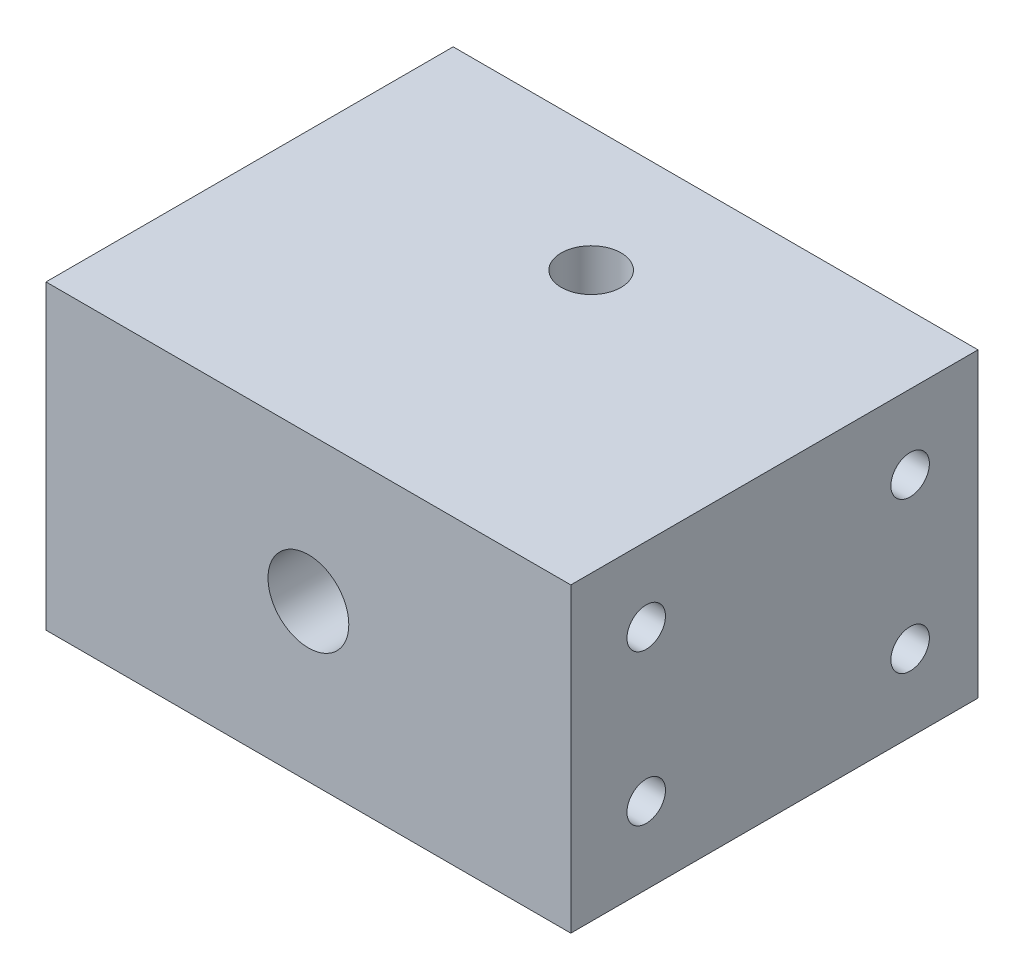
ISO-10303-21;
HEADER;
FILE_DESCRIPTION(('STEP AP214'),'2;1');
FILE_NAME('part.step','',(''),(''),'','','');
FILE_SCHEMA(('AUTOMOTIVE_DESIGN { 1 0 10303 214 1 1 1 1 }'));
ENDSEC;
DATA;
#1=APPLICATION_CONTEXT('core data for automotive mechanical design processes');
#2=APPLICATION_PROTOCOL_DEFINITION('international standard','automotive_design',2000,#1);
#3=PRODUCT_CONTEXT('',#1,'mechanical');
#4=PRODUCT('Part','Part','',(#3));
#5=PRODUCT_RELATED_PRODUCT_CATEGORY('part','',(#4));
#6=PRODUCT_DEFINITION_FORMATION('','',#4);
#7=PRODUCT_DEFINITION_CONTEXT('part definition',#1,'design');
#8=PRODUCT_DEFINITION('design','',#6,#7);
#9=PRODUCT_DEFINITION_SHAPE('','',#8);
#10=(LENGTH_UNIT() NAMED_UNIT(*) SI_UNIT(.MILLI.,.METRE.));
#11=(NAMED_UNIT(*) PLANE_ANGLE_UNIT() SI_UNIT($,.RADIAN.));
#12=(NAMED_UNIT(*) SI_UNIT($,.STERADIAN.) SOLID_ANGLE_UNIT());
#13=UNCERTAINTY_MEASURE_WITH_UNIT(LENGTH_MEASURE(1.E-05),#10,'distance_accuracy_value','');
#14=(GEOMETRIC_REPRESENTATION_CONTEXT(3) GLOBAL_UNCERTAINTY_ASSIGNED_CONTEXT((#13)) GLOBAL_UNIT_ASSIGNED_CONTEXT((#10,
#11,#12)) REPRESENTATION_CONTEXT('',''));
#15=CARTESIAN_POINT('',(0.,0.,0.));
#16=DIRECTION('',(0.,0.,1.));
#17=DIRECTION('',(1.,0.,0.));
#18=AXIS2_PLACEMENT_3D('',#15,#16,#17);
#19=CARTESIAN_POINT('',(-34.8,40.,-37.5));
#20=DIRECTION('',(1.,0.,0.));
#21=DIRECTION('',(0.,0.,-1.));
#22=AXIS2_PLACEMENT_3D('',#19,#20,#21);
#23=PLANE('',#22);
#24=CARTESIAN_POINT('',(-34.8,30.16,-7.50000000000002));
#25=DIRECTION('',(-1.,0.,0.));
#26=DIRECTION('',(0.,0.,1.));
#27=AXIS2_PLACEMENT_3D('',#24,#25,#26);
#28=CIRCLE('',#27,2.5527);
#29=CARTESIAN_POINT('',(-34.8,30.16,-4.94730000000002));
#30=VERTEX_POINT('',#29);
#31=EDGE_CURVE('E165',#30,#30,#28,.T.);
#32=ORIENTED_EDGE('',*,*,#31,.F.);
#33=EDGE_LOOP('',(#32));
#34=FACE_BOUND('',#33,.T.);
#35=CARTESIAN_POINT('',(-34.8,10.16,-7.50000000000001));
#36=DIRECTION('',(-1.,0.,0.));
#37=DIRECTION('',(0.,0.,1.));
#38=AXIS2_PLACEMENT_3D('',#35,#36,#37);
#39=CIRCLE('',#38,2.5527);
#40=CARTESIAN_POINT('',(-34.8,10.16,-4.94730000000001));
#41=VERTEX_POINT('',#40);
#42=EDGE_CURVE('E173',#41,#41,#39,.T.);
#43=ORIENTED_EDGE('',*,*,#42,.F.);
#44=EDGE_LOOP('',(#43));
#45=FACE_BOUND('',#44,.T.);
#46=CARTESIAN_POINT('',(-34.8,10.16,27.5));
#47=DIRECTION('',(-1.,0.,0.));
#48=DIRECTION('',(0.,0.,1.));
#49=AXIS2_PLACEMENT_3D('',#46,#47,#48);
#50=CIRCLE('',#49,2.5527);
#51=CARTESIAN_POINT('',(-34.8,10.16,30.0527));
#52=VERTEX_POINT('',#51);
#53=EDGE_CURVE('E181',#52,#52,#50,.T.);
#54=ORIENTED_EDGE('',*,*,#53,.F.);
#55=EDGE_LOOP('',(#54));
#56=FACE_BOUND('',#55,.T.);
#57=CARTESIAN_POINT('',(-34.8,30.16,27.5));
#58=DIRECTION('',(-1.,0.,0.));
#59=DIRECTION('',(0.,0.,1.));
#60=AXIS2_PLACEMENT_3D('',#57,#58,#59);
#61=CIRCLE('',#60,2.5527);
#62=CARTESIAN_POINT('',(-34.8,30.16,30.0527));
#63=VERTEX_POINT('',#62);
#64=EDGE_CURVE('E189',#63,#63,#61,.T.);
#65=ORIENTED_EDGE('',*,*,#64,.F.);
#66=EDGE_LOOP('',(#65));
#67=FACE_BOUND('',#66,.T.);
#68=DIRECTION('',(0.,1.,0.));
#69=VECTOR('',#68,1.);
#70=CARTESIAN_POINT('',(-34.8,40.,-16.5));
#71=LINE('',#70,#69);
#72=CARTESIAN_POINT('',(-34.8,0.,-16.5));
#73=VERTEX_POINT('',#72);
#74=CARTESIAN_POINT('',(-34.8,40.,-16.5));
#75=VERTEX_POINT('',#74);
#76=EDGE_CURVE('E243',#73,#75,#71,.T.);
#77=ORIENTED_EDGE('',*,*,#76,.F.);
#78=DIRECTION('',(0.,0.,1.));
#79=VECTOR('',#78,1.);
#80=CARTESIAN_POINT('',(-34.8,0.,-37.5));
#81=LINE('',#80,#79);
#82=CARTESIAN_POINT('',(-34.8,0.,37.5));
#83=VERTEX_POINT('',#82);
#84=EDGE_CURVE('E246',#73,#83,#81,.T.);
#85=ORIENTED_EDGE('',*,*,#84,.T.);
#86=DIRECTION('',(0.,-1.,0.));
#87=VECTOR('',#86,1.);
#88=CARTESIAN_POINT('',(-34.8,40.,37.5));
#89=LINE('',#88,#87);
#90=CARTESIAN_POINT('',(-34.8,40.,37.5));
#91=VERTEX_POINT('',#90);
#92=EDGE_CURVE('E270',#91,#83,#89,.T.);
#93=ORIENTED_EDGE('',*,*,#92,.F.);
#94=DIRECTION('',(0.,0.,1.));
#95=VECTOR('',#94,1.);
#96=CARTESIAN_POINT('',(-34.8,40.,-37.5));
#97=LINE('',#96,#95);
#98=EDGE_CURVE('E247',#75,#91,#97,.T.);
#99=ORIENTED_EDGE('',*,*,#98,.F.);
#100=EDGE_LOOP('',(#77,#85,#93,#99));
#101=FACE_BOUND('',#100,.T.);
#102=ADVANCED_FACE('F39',(#34,#45,#56,#67,#101),#23,.F.);
#103=CARTESIAN_POINT('',(34.8,40.,-37.5));
#104=DIRECTION('',(-1.,0.,0.));
#105=DIRECTION('',(0.,0.,1.));
#106=AXIS2_PLACEMENT_3D('',#103,#104,#105);
#107=PLANE('',#106);
#108=CARTESIAN_POINT('',(34.8,30.16,-7.50000000000002));
#109=DIRECTION('',(1.,0.,0.));
#110=DIRECTION('',(0.,0.,-1.));
#111=AXIS2_PLACEMENT_3D('',#108,#109,#110);
#112=CIRCLE('',#111,2.5527);
#113=CARTESIAN_POINT('',(34.8,30.16,-10.0527));
#114=VERTEX_POINT('',#113);
#115=EDGE_CURVE('E197',#114,#114,#112,.T.);
#116=ORIENTED_EDGE('',*,*,#115,.F.);
#117=EDGE_LOOP('',(#116));
#118=FACE_BOUND('',#117,.T.);
#119=CARTESIAN_POINT('',(34.8,10.16,-7.50000000000001));
#120=DIRECTION('',(1.,0.,0.));
#121=DIRECTION('',(0.,0.,-1.));
#122=AXIS2_PLACEMENT_3D('',#119,#120,#121);
#123=CIRCLE('',#122,2.5527);
#124=CARTESIAN_POINT('',(34.8,10.16,-10.0527));
#125=VERTEX_POINT('',#124);
#126=EDGE_CURVE('E205',#125,#125,#123,.T.);
#127=ORIENTED_EDGE('',*,*,#126,.F.);
#128=EDGE_LOOP('',(#127));
#129=FACE_BOUND('',#128,.T.);
#130=CARTESIAN_POINT('',(34.8,10.16,27.5));
#131=DIRECTION('',(1.,0.,0.));
#132=DIRECTION('',(0.,0.,-1.));
#133=AXIS2_PLACEMENT_3D('',#130,#131,#132);
#134=CIRCLE('',#133,2.5527);
#135=CARTESIAN_POINT('',(34.8,10.16,24.9473));
#136=VERTEX_POINT('',#135);
#137=EDGE_CURVE('E213',#136,#136,#134,.T.);
#138=ORIENTED_EDGE('',*,*,#137,.F.);
#139=EDGE_LOOP('',(#138));
#140=FACE_BOUND('',#139,.T.);
#141=CARTESIAN_POINT('',(34.8,30.16,27.5));
#142=DIRECTION('',(1.,0.,0.));
#143=DIRECTION('',(0.,0.,-1.));
#144=AXIS2_PLACEMENT_3D('',#141,#142,#143);
#145=CIRCLE('',#144,2.5527);
#146=CARTESIAN_POINT('',(34.8,30.16,24.9473));
#147=VERTEX_POINT('',#146);
#148=EDGE_CURVE('E221',#147,#147,#145,.T.);
#149=ORIENTED_EDGE('',*,*,#148,.F.);
#150=EDGE_LOOP('',(#149));
#151=FACE_BOUND('',#150,.T.);
#152=DIRECTION('',(0.,-1.,0.));
#153=VECTOR('',#152,1.);
#154=CARTESIAN_POINT('',(34.8,40.,-16.5));
#155=LINE('',#154,#153);
#156=CARTESIAN_POINT('',(34.8,40.,-16.5));
#157=VERTEX_POINT('',#156);
#158=CARTESIAN_POINT('',(34.8,0.,-16.5));
#159=VERTEX_POINT('',#158);
#160=EDGE_CURVE('E240',#157,#159,#155,.T.);
#161=ORIENTED_EDGE('',*,*,#160,.F.);
#162=DIRECTION('',(0.,0.,-1.));
#163=VECTOR('',#162,1.);
#164=CARTESIAN_POINT('',(34.8,40.,-37.5));
#165=LINE('',#164,#163);
#166=CARTESIAN_POINT('',(34.8,40.,37.5));
#167=VERTEX_POINT('',#166);
#168=EDGE_CURVE('E254',#167,#157,#165,.T.);
#169=ORIENTED_EDGE('',*,*,#168,.F.);
#170=DIRECTION('',(0.,-1.,0.));
#171=VECTOR('',#170,1.);
#172=CARTESIAN_POINT('',(34.8,40.,37.5));
#173=LINE('',#172,#171);
#174=CARTESIAN_POINT('',(34.8,0.,37.5));
#175=VERTEX_POINT('',#174);
#176=EDGE_CURVE('E258',#167,#175,#173,.T.);
#177=ORIENTED_EDGE('',*,*,#176,.T.);
#178=DIRECTION('',(0.,0.,-1.));
#179=VECTOR('',#178,1.);
#180=CARTESIAN_POINT('',(34.8,0.,-37.5));
#181=LINE('',#180,#179);
#182=EDGE_CURVE('E251',#175,#159,#181,.T.);
#183=ORIENTED_EDGE('',*,*,#182,.T.);
#184=EDGE_LOOP('',(#161,#169,#177,#183));
#185=FACE_BOUND('',#184,.T.);
#186=ADVANCED_FACE('F333',(#118,#129,#140,#151,#185),#107,.F.);
#187=CARTESIAN_POINT('',(0.,40.,0.));
#188=DIRECTION('',(0.,1.,0.));
#189=DIRECTION('',(0.,0.,1.));
#190=AXIS2_PLACEMENT_3D('',#187,#188,#189);
#191=PLANE('',#190);
#192=CARTESIAN_POINT('',(0.,40.,0.));
#193=DIRECTION('',(0.,1.,0.));
#194=DIRECTION('',(0.,0.,1.));
#195=AXIS2_PLACEMENT_3D('',#192,#193,#194);
#196=CIRCLE('',#195,3.96875);
#197=CARTESIAN_POINT('',(0.,40.,3.96875));
#198=VERTEX_POINT('',#197);
#199=EDGE_CURVE('E229',#198,#198,#196,.T.);
#200=ORIENTED_EDGE('',*,*,#199,.F.);
#201=EDGE_LOOP('',(#200));
#202=FACE_BOUND('',#201,.T.);
#203=ORIENTED_EDGE('',*,*,#168,.T.);
#204=DIRECTION('',(1.,0.,0.));
#205=VECTOR('',#204,1.);
#206=CARTESIAN_POINT('',(-72.700692263572,40.,-16.5));
#207=LINE('',#206,#205);
#208=EDGE_CURVE('E237',#75,#157,#207,.T.);
#209=ORIENTED_EDGE('',*,*,#208,.F.);
#210=ORIENTED_EDGE('',*,*,#98,.T.);
#211=DIRECTION('',(1.,0.,0.));
#212=VECTOR('',#211,1.);
#213=CARTESIAN_POINT('',(-34.8,40.,37.5));
#214=LINE('',#213,#212);
#215=EDGE_CURVE('E250',#91,#167,#214,.T.);
#216=ORIENTED_EDGE('',*,*,#215,.T.);
#217=EDGE_LOOP('',(#203,#209,#210,#216));
#218=FACE_BOUND('',#217,.T.);
#219=ADVANCED_FACE('F330',(#202,#218),#191,.T.);
#220=CARTESIAN_POINT('',(0.,0.,0.));
#221=DIRECTION('',(0.,1.,0.));
#222=DIRECTION('',(0.,0.,1.));
#223=AXIS2_PLACEMENT_3D('',#220,#221,#222);
#224=PLANE('',#223);
#225=DIRECTION('',(-1.,0.,0.));
#226=VECTOR('',#225,1.);
#227=CARTESIAN_POINT('',(0.,0.,-16.5));
#228=LINE('',#227,#226);
#229=CARTESIAN_POINT('',(-20.,0.,-16.5));
#230=VERTEX_POINT('',#229);
#231=EDGE_CURVE('E274',#230,#73,#228,.T.);
#232=ORIENTED_EDGE('',*,*,#231,.F.);
#233=DIRECTION('',(0.,0.,1.));
#234=VECTOR('',#233,1.);
#235=CARTESIAN_POINT('',(-20.,0.,0.));
#236=LINE('',#235,#234);
#237=CARTESIAN_POINT('',(-20.,0.,20.1823199310233));
#238=VERTEX_POINT('',#237);
#239=EDGE_CURVE('E154',#230,#238,#236,.T.);
#240=ORIENTED_EDGE('',*,*,#239,.T.);
#241=CARTESIAN_POINT('',(-18.,0.,20.1823199310233));
#242=DIRECTION('',(0.,1.,0.));
#243=DIRECTION('',(0.,0.,-1.));
#244=AXIS2_PLACEMENT_3D('',#241,#242,#243);
#245=ELLIPSE('',#244,4.73240316630509,2.);
#246=CARTESIAN_POINT('',(-18.,0.,24.9147230973284));
#247=VERTEX_POINT('',#246);
#248=EDGE_CURVE('E303',#238,#247,#245,.T.);
#249=ORIENTED_EDGE('',*,*,#248,.T.);
#250=DIRECTION('',(1.,0.,0.));
#251=VECTOR('',#250,1.);
#252=CARTESIAN_POINT('',(0.,0.,24.9147230973284));
#253=LINE('',#252,#251);
#254=CARTESIAN_POINT('',(18.,0.,24.9147230973284));
#255=VERTEX_POINT('',#254);
#256=EDGE_CURVE('E162',#247,#255,#253,.T.);
#257=ORIENTED_EDGE('',*,*,#256,.T.);
#258=CARTESIAN_POINT('',(18.,0.,20.1823199310233));
#259=DIRECTION('',(0.,1.,0.));
#260=DIRECTION('',(0.,0.,1.));
#261=AXIS2_PLACEMENT_3D('',#258,#259,#260);
#262=ELLIPSE('',#261,4.73240316630509,2.);
#263=CARTESIAN_POINT('',(20.,0.,20.1823199310233));
#264=VERTEX_POINT('',#263);
#265=EDGE_CURVE('E48',#255,#264,#262,.T.);
#266=ORIENTED_EDGE('',*,*,#265,.T.);
#267=DIRECTION('',(0.,0.,1.));
#268=VECTOR('',#267,1.);
#269=CARTESIAN_POINT('',(20.,0.,0.));
#270=LINE('',#269,#268);
#271=CARTESIAN_POINT('',(20.,0.,-16.5));
#272=VERTEX_POINT('',#271);
#273=EDGE_CURVE('E149',#272,#264,#270,.T.);
#274=ORIENTED_EDGE('',*,*,#273,.F.);
#275=EDGE_CURVE('E275',#159,#272,#228,.T.);
#276=ORIENTED_EDGE('',*,*,#275,.F.);
#277=ORIENTED_EDGE('',*,*,#182,.F.);
#278=DIRECTION('',(1.,0.,0.));
#279=VECTOR('',#278,1.);
#280=CARTESIAN_POINT('',(-34.8,0.,37.5));
#281=LINE('',#280,#279);
#282=EDGE_CURVE('E261',#83,#175,#281,.T.);
#283=ORIENTED_EDGE('',*,*,#282,.F.);
#284=ORIENTED_EDGE('',*,*,#84,.F.);
#285=EDGE_LOOP('',(#232,#240,#249,#257,#266,#274,#276,#277,#283,#284));
#286=FACE_BOUND('',#285,.T.);
#287=ADVANCED_FACE('F321',(#286),#224,.F.);
#288=CARTESIAN_POINT('',(-34.8,40.,37.5));
#289=DIRECTION('',(0.,0.,-1.));
#290=DIRECTION('',(-1.,0.,0.));
#291=AXIS2_PLACEMENT_3D('',#288,#289,#290);
#292=PLANE('',#291);
#293=CARTESIAN_POINT('',(0.,20.7188631564298,37.5));
#294=DIRECTION('',(0.,0.,1.));
#295=DIRECTION('',(1.,0.,0.));
#296=AXIS2_PLACEMENT_3D('',#293,#294,#295);
#297=CIRCLE('',#296,5.35813);
#298=CARTESIAN_POINT('',(5.35813,20.7188631564298,37.5));
#299=VERTEX_POINT('',#298);
#300=EDGE_CURVE('E150',#299,#299,#297,.T.);
#301=ORIENTED_EDGE('',*,*,#300,.F.);
#302=EDGE_LOOP('',(#301));
#303=FACE_BOUND('',#302,.T.);
#304=ORIENTED_EDGE('',*,*,#282,.T.);
#305=ORIENTED_EDGE('',*,*,#176,.F.);
#306=ORIENTED_EDGE('',*,*,#215,.F.);
#307=ORIENTED_EDGE('',*,*,#92,.T.);
#308=EDGE_LOOP('',(#304,#305,#306,#307));
#309=FACE_BOUND('',#308,.T.);
#310=ADVANCED_FACE('F327',(#303,#309),#292,.F.);
#311=CARTESIAN_POINT('',(-72.700692263572,40.,-16.5));
#312=DIRECTION('',(0.,0.,-1.));
#313=DIRECTION('',(-1.,0.,0.));
#314=AXIS2_PLACEMENT_3D('',#311,#312,#313);
#315=PLANE('',#314);
#316=DIRECTION('',(0.,1.,0.));
#317=VECTOR('',#316,1.);
#318=CARTESIAN_POINT('',(-20.,40.,-16.5));
#319=LINE('',#318,#317);
#320=CARTESIAN_POINT('',(-20.,17.1052467027275,-16.5));
#321=VERTEX_POINT('',#320);
#322=EDGE_CURVE('E286',#230,#321,#319,.T.);
#323=ORIENTED_EDGE('',*,*,#322,.F.);
#324=ORIENTED_EDGE('',*,*,#231,.T.);
#325=ORIENTED_EDGE('',*,*,#76,.T.);
#326=ORIENTED_EDGE('',*,*,#208,.T.);
#327=ORIENTED_EDGE('',*,*,#160,.T.);
#328=ORIENTED_EDGE('',*,*,#275,.T.);
#329=DIRECTION('',(0.,1.,0.));
#330=VECTOR('',#329,1.);
#331=CARTESIAN_POINT('',(20.,40.,-16.5));
#332=LINE('',#331,#330);
#333=CARTESIAN_POINT('',(20.,17.1052467027275,-16.5));
#334=VERTEX_POINT('',#333);
#335=EDGE_CURVE('E279',#272,#334,#332,.T.);
#336=ORIENTED_EDGE('',*,*,#335,.T.);
#337=CARTESIAN_POINT('',(18.,17.1052467027275,-16.5));
#338=DIRECTION('',(0.,0.,-1.));
#339=DIRECTION('',(0.,-1.,0.));
#340=AXIS2_PLACEMENT_3D('',#337,#338,#339);
#341=ELLIPSE('',#340,2.20675583792497,2.);
#342=CARTESIAN_POINT('',(18.,19.3120025406524,-16.5));
#343=VERTEX_POINT('',#342);
#344=EDGE_CURVE('E11',#334,#343,#341,.F.);
#345=ORIENTED_EDGE('',*,*,#344,.T.);
#346=DIRECTION('',(1.,0.,0.));
#347=VECTOR('',#346,1.);
#348=CARTESIAN_POINT('',(-72.700692263572,19.3120025406524,-16.5));
#349=LINE('',#348,#347);
#350=CARTESIAN_POINT('',(-18.,19.3120025406524,-16.5));
#351=VERTEX_POINT('',#350);
#352=EDGE_CURVE('E282',#351,#343,#349,.T.);
#353=ORIENTED_EDGE('',*,*,#352,.F.);
#354=CARTESIAN_POINT('',(-18.,17.1052467027275,-16.5));
#355=DIRECTION('',(0.,0.,-1.));
#356=DIRECTION('',(0.,1.,0.));
#357=AXIS2_PLACEMENT_3D('',#354,#355,#356);
#358=ELLIPSE('',#357,2.20675583792497,2.);
#359=EDGE_CURVE('E306',#351,#321,#358,.F.);
#360=ORIENTED_EDGE('',*,*,#359,.T.);
#361=EDGE_LOOP('',(#323,#324,#325,#326,#327,#328,#336,#345,#353,#360));
#362=FACE_BOUND('',#361,.T.);
#363=ADVANCED_FACE('F314',(#362),#315,.T.);
#364=CARTESIAN_POINT('',(0.,24.125,0.));
#365=DIRECTION('',(0.,1.,0.));
#366=DIRECTION('',(0.,0.,1.));
#367=AXIS2_PLACEMENT_3D('',#364,#365,#366);
#368=CONICAL_SURFACE('',#367,3.96875,1.02974425867665);
#369=CARTESIAN_POINT('',(0.,21.7403344182344,0.));
#370=VERTEX_POINT('',#369);
#371=VERTEX_LOOP('',#370);
#372=FACE_BOUND('',#371,.T.);
#373=CARTESIAN_POINT('',(0.,24.125,0.));
#374=DIRECTION('',(0.,1.,0.));
#375=DIRECTION('',(0.,0.,1.));
#376=AXIS2_PLACEMENT_3D('',#373,#374,#375);
#377=CIRCLE('',#376,3.96875);
#378=CARTESIAN_POINT('',(0.,24.125,3.96875));
#379=VERTEX_POINT('',#378);
#380=EDGE_CURVE('E233',#379,#379,#377,.T.);
#381=ORIENTED_EDGE('',*,*,#380,.T.);
#382=EDGE_LOOP('',(#381));
#383=FACE_BOUND('',#382,.T.);
#384=ADVANCED_FACE('F447',(#372,#383),#368,.F.);
#385=CARTESIAN_POINT('',(0.,40.,0.));
#386=DIRECTION('',(0.,1.,0.));
#387=DIRECTION('',(0.,0.,1.));
#388=AXIS2_PLACEMENT_3D('',#385,#386,#387);
#389=CYLINDRICAL_SURFACE('',#388,3.96875);
#390=ORIENTED_EDGE('',*,*,#380,.F.);
#391=EDGE_LOOP('',(#390));
#392=FACE_BOUND('',#391,.T.);
#393=ORIENTED_EDGE('',*,*,#199,.T.);
#394=EDGE_LOOP('',(#393));
#395=FACE_BOUND('',#394,.T.);
#396=ADVANCED_FACE('F443',(#392,#395),#389,.F.);
#397=CARTESIAN_POINT('',(21.8,30.16,27.5));
#398=DIRECTION('',(1.,0.,0.));
#399=DIRECTION('',(0.,0.,-1.));
#400=AXIS2_PLACEMENT_3D('',#397,#398,#399);
#401=CONICAL_SURFACE('',#400,2.55269999999999,1.02974425867665);
#402=CARTESIAN_POINT('',(20.2661830978084,30.16,27.5));
#403=VERTEX_POINT('',#402);
#404=VERTEX_LOOP('',#403);
#405=FACE_BOUND('',#404,.T.);
#406=CARTESIAN_POINT('',(21.8,30.16,27.5));
#407=DIRECTION('',(1.,0.,0.));
#408=DIRECTION('',(0.,0.,-1.));
#409=AXIS2_PLACEMENT_3D('',#406,#407,#408);
#410=CIRCLE('',#409,2.55269999999999);
#411=CARTESIAN_POINT('',(21.8,30.16,24.9473));
#412=VERTEX_POINT('',#411);
#413=EDGE_CURVE('E225',#412,#412,#410,.T.);
#414=ORIENTED_EDGE('',*,*,#413,.T.);
#415=EDGE_LOOP('',(#414));
#416=FACE_BOUND('',#415,.T.);
#417=ADVANCED_FACE('F439',(#405,#416),#401,.F.);
#418=CARTESIAN_POINT('',(34.8,30.16,27.5));
#419=DIRECTION('',(1.,0.,0.));
#420=DIRECTION('',(0.,0.,-1.));
#421=AXIS2_PLACEMENT_3D('',#418,#419,#420);
#422=CYLINDRICAL_SURFACE('',#421,2.5527);
#423=ORIENTED_EDGE('',*,*,#413,.F.);
#424=EDGE_LOOP('',(#423));
#425=FACE_BOUND('',#424,.T.);
#426=ORIENTED_EDGE('',*,*,#148,.T.);
#427=EDGE_LOOP('',(#426));
#428=FACE_BOUND('',#427,.T.);
#429=ADVANCED_FACE('F435',(#425,#428),#422,.F.);
#430=CARTESIAN_POINT('',(21.8,10.16,27.5));
#431=DIRECTION('',(1.,0.,0.));
#432=DIRECTION('',(0.,0.,-1.));
#433=AXIS2_PLACEMENT_3D('',#430,#431,#432);
#434=CONICAL_SURFACE('',#433,2.5527,1.02974425867665);
#435=CARTESIAN_POINT('',(20.2661830978084,10.16,27.5));
#436=VERTEX_POINT('',#435);
#437=VERTEX_LOOP('',#436);
#438=FACE_BOUND('',#437,.T.);
#439=CARTESIAN_POINT('',(21.8,10.16,27.5));
#440=DIRECTION('',(1.,0.,0.));
#441=DIRECTION('',(0.,0.,-1.));
#442=AXIS2_PLACEMENT_3D('',#439,#440,#441);
#443=CIRCLE('',#442,2.5527);
#444=CARTESIAN_POINT('',(21.8,10.16,24.9473));
#445=VERTEX_POINT('',#444);
#446=EDGE_CURVE('E217',#445,#445,#443,.T.);
#447=ORIENTED_EDGE('',*,*,#446,.T.);
#448=EDGE_LOOP('',(#447));
#449=FACE_BOUND('',#448,.T.);
#450=ADVANCED_FACE('F431',(#438,#449),#434,.F.);
#451=CARTESIAN_POINT('',(34.8,10.16,27.5));
#452=DIRECTION('',(1.,0.,0.));
#453=DIRECTION('',(0.,0.,-1.));
#454=AXIS2_PLACEMENT_3D('',#451,#452,#453);
#455=CYLINDRICAL_SURFACE('',#454,2.5527);
#456=ORIENTED_EDGE('',*,*,#446,.F.);
#457=EDGE_LOOP('',(#456));
#458=FACE_BOUND('',#457,.T.);
#459=ORIENTED_EDGE('',*,*,#137,.T.);
#460=EDGE_LOOP('',(#459));
#461=FACE_BOUND('',#460,.T.);
#462=ADVANCED_FACE('F427',(#458,#461),#455,.F.);
#463=CARTESIAN_POINT('',(21.8,10.16,-7.50000000000001));
#464=DIRECTION('',(1.,0.,0.));
#465=DIRECTION('',(0.,0.,-1.));
#466=AXIS2_PLACEMENT_3D('',#463,#464,#465);
#467=CONICAL_SURFACE('',#466,2.5527,1.02974425867665);
#468=CARTESIAN_POINT('',(20.2661830978084,10.16,-7.50000000000001));
#469=VERTEX_POINT('',#468);
#470=VERTEX_LOOP('',#469);
#471=FACE_BOUND('',#470,.T.);
#472=CARTESIAN_POINT('',(21.8,10.16,-7.50000000000001));
#473=DIRECTION('',(1.,0.,0.));
#474=DIRECTION('',(0.,0.,-1.));
#475=AXIS2_PLACEMENT_3D('',#472,#473,#474);
#476=CIRCLE('',#475,2.5527);
#477=CARTESIAN_POINT('',(21.8,10.16,-10.0527));
#478=VERTEX_POINT('',#477);
#479=EDGE_CURVE('E209',#478,#478,#476,.T.);
#480=ORIENTED_EDGE('',*,*,#479,.T.);
#481=EDGE_LOOP('',(#480));
#482=FACE_BOUND('',#481,.T.);
#483=ADVANCED_FACE('F423',(#471,#482),#467,.F.);
#484=CARTESIAN_POINT('',(34.8,10.16,-7.50000000000001));
#485=DIRECTION('',(1.,0.,0.));
#486=DIRECTION('',(0.,0.,-1.));
#487=AXIS2_PLACEMENT_3D('',#484,#485,#486);
#488=CYLINDRICAL_SURFACE('',#487,2.5527);
#489=ORIENTED_EDGE('',*,*,#479,.F.);
#490=EDGE_LOOP('',(#489));
#491=FACE_BOUND('',#490,.T.);
#492=ORIENTED_EDGE('',*,*,#126,.T.);
#493=EDGE_LOOP('',(#492));
#494=FACE_BOUND('',#493,.T.);
#495=ADVANCED_FACE('F419',(#491,#494),#488,.F.);
#496=CARTESIAN_POINT('',(21.8,30.16,-7.50000000000001));
#497=DIRECTION('',(1.,0.,0.));
#498=DIRECTION('',(0.,0.,-1.));
#499=AXIS2_PLACEMENT_3D('',#496,#497,#498);
#500=CONICAL_SURFACE('',#499,2.5527,1.02974425867665);
#501=CARTESIAN_POINT('',(20.2661830978084,30.16,-7.50000000000001));
#502=VERTEX_POINT('',#501);
#503=VERTEX_LOOP('',#502);
#504=FACE_BOUND('',#503,.T.);
#505=CARTESIAN_POINT('',(21.8,30.16,-7.50000000000001));
#506=DIRECTION('',(1.,0.,0.));
#507=DIRECTION('',(0.,0.,-1.));
#508=AXIS2_PLACEMENT_3D('',#505,#506,#507);
#509=CIRCLE('',#508,2.5527);
#510=CARTESIAN_POINT('',(21.8,30.16,-10.0527));
#511=VERTEX_POINT('',#510);
#512=EDGE_CURVE('E201',#511,#511,#509,.T.);
#513=ORIENTED_EDGE('',*,*,#512,.T.);
#514=EDGE_LOOP('',(#513));
#515=FACE_BOUND('',#514,.T.);
#516=ADVANCED_FACE('F415',(#504,#515),#500,.F.);
#517=CARTESIAN_POINT('',(34.8,30.16,-7.50000000000002));
#518=DIRECTION('',(1.,0.,0.));
#519=DIRECTION('',(0.,0.,-1.));
#520=AXIS2_PLACEMENT_3D('',#517,#518,#519);
#521=CYLINDRICAL_SURFACE('',#520,2.5527);
#522=ORIENTED_EDGE('',*,*,#512,.F.);
#523=EDGE_LOOP('',(#522));
#524=FACE_BOUND('',#523,.T.);
#525=ORIENTED_EDGE('',*,*,#115,.T.);
#526=EDGE_LOOP('',(#525));
#527=FACE_BOUND('',#526,.T.);
#528=ADVANCED_FACE('F411',(#524,#527),#521,.F.);
#529=CARTESIAN_POINT('',(-21.8,30.16,27.5));
#530=DIRECTION('',(-1.,0.,0.));
#531=DIRECTION('',(0.,0.,1.));
#532=AXIS2_PLACEMENT_3D('',#529,#530,#531);
#533=CONICAL_SURFACE('',#532,2.55269999999999,1.02974425867665);
#534=CARTESIAN_POINT('',(-20.2661830978084,30.16,27.5));
#535=VERTEX_POINT('',#534);
#536=VERTEX_LOOP('',#535);
#537=FACE_BOUND('',#536,.T.);
#538=CARTESIAN_POINT('',(-21.8,30.16,27.5));
#539=DIRECTION('',(-1.,0.,0.));
#540=DIRECTION('',(0.,0.,1.));
#541=AXIS2_PLACEMENT_3D('',#538,#539,#540);
#542=CIRCLE('',#541,2.55269999999999);
#543=CARTESIAN_POINT('',(-21.8,30.16,30.0527));
#544=VERTEX_POINT('',#543);
#545=EDGE_CURVE('E193',#544,#544,#542,.T.);
#546=ORIENTED_EDGE('',*,*,#545,.T.);
#547=EDGE_LOOP('',(#546));
#548=FACE_BOUND('',#547,.T.);
#549=ADVANCED_FACE('F407',(#537,#548),#533,.F.);
#550=CARTESIAN_POINT('',(-34.8,30.16,27.5));
#551=DIRECTION('',(-1.,0.,0.));
#552=DIRECTION('',(0.,0.,1.));
#553=AXIS2_PLACEMENT_3D('',#550,#551,#552);
#554=CYLINDRICAL_SURFACE('',#553,2.5527);
#555=ORIENTED_EDGE('',*,*,#545,.F.);
#556=EDGE_LOOP('',(#555));
#557=FACE_BOUND('',#556,.T.);
#558=ORIENTED_EDGE('',*,*,#64,.T.);
#559=EDGE_LOOP('',(#558));
#560=FACE_BOUND('',#559,.T.);
#561=ADVANCED_FACE('F403',(#557,#560),#554,.F.);
#562=CARTESIAN_POINT('',(-21.8,10.16,27.5));
#563=DIRECTION('',(-1.,0.,0.));
#564=DIRECTION('',(0.,0.,1.));
#565=AXIS2_PLACEMENT_3D('',#562,#563,#564);
#566=CONICAL_SURFACE('',#565,2.5527,1.02974425867665);
#567=CARTESIAN_POINT('',(-20.2661830978084,10.16,27.5));
#568=VERTEX_POINT('',#567);
#569=VERTEX_LOOP('',#568);
#570=FACE_BOUND('',#569,.T.);
#571=CARTESIAN_POINT('',(-21.8,10.16,27.5));
#572=DIRECTION('',(-1.,0.,0.));
#573=DIRECTION('',(0.,0.,1.));
#574=AXIS2_PLACEMENT_3D('',#571,#572,#573);
#575=CIRCLE('',#574,2.5527);
#576=CARTESIAN_POINT('',(-21.8,10.16,30.0527));
#577=VERTEX_POINT('',#576);
#578=EDGE_CURVE('E185',#577,#577,#575,.T.);
#579=ORIENTED_EDGE('',*,*,#578,.T.);
#580=EDGE_LOOP('',(#579));
#581=FACE_BOUND('',#580,.T.);
#582=ADVANCED_FACE('F399',(#570,#581),#566,.F.);
#583=CARTESIAN_POINT('',(-34.8,10.16,27.5));
#584=DIRECTION('',(-1.,0.,0.));
#585=DIRECTION('',(0.,0.,1.));
#586=AXIS2_PLACEMENT_3D('',#583,#584,#585);
#587=CYLINDRICAL_SURFACE('',#586,2.5527);
#588=ORIENTED_EDGE('',*,*,#578,.F.);
#589=EDGE_LOOP('',(#588));
#590=FACE_BOUND('',#589,.T.);
#591=ORIENTED_EDGE('',*,*,#53,.T.);
#592=EDGE_LOOP('',(#591));
#593=FACE_BOUND('',#592,.T.);
#594=ADVANCED_FACE('F395',(#590,#593),#587,.F.);
#595=CARTESIAN_POINT('',(-21.8,10.16,-7.50000000000001));
#596=DIRECTION('',(-1.,0.,0.));
#597=DIRECTION('',(0.,0.,1.));
#598=AXIS2_PLACEMENT_3D('',#595,#596,#597);
#599=CONICAL_SURFACE('',#598,2.5527,1.02974425867665);
#600=CARTESIAN_POINT('',(-20.2661830978084,10.16,-7.50000000000001));
#601=VERTEX_POINT('',#600);
#602=VERTEX_LOOP('',#601);
#603=FACE_BOUND('',#602,.T.);
#604=CARTESIAN_POINT('',(-21.8,10.16,-7.50000000000001));
#605=DIRECTION('',(-1.,0.,0.));
#606=DIRECTION('',(0.,0.,1.));
#607=AXIS2_PLACEMENT_3D('',#604,#605,#606);
#608=CIRCLE('',#607,2.5527);
#609=CARTESIAN_POINT('',(-21.8,10.16,-4.94730000000001));
#610=VERTEX_POINT('',#609);
#611=EDGE_CURVE('E177',#610,#610,#608,.T.);
#612=ORIENTED_EDGE('',*,*,#611,.T.);
#613=EDGE_LOOP('',(#612));
#614=FACE_BOUND('',#613,.T.);
#615=ADVANCED_FACE('F391',(#603,#614),#599,.F.);
#616=CARTESIAN_POINT('',(-34.8,10.16,-7.50000000000001));
#617=DIRECTION('',(-1.,0.,0.));
#618=DIRECTION('',(0.,0.,1.));
#619=AXIS2_PLACEMENT_3D('',#616,#617,#618);
#620=CYLINDRICAL_SURFACE('',#619,2.5527);
#621=ORIENTED_EDGE('',*,*,#611,.F.);
#622=EDGE_LOOP('',(#621));
#623=FACE_BOUND('',#622,.T.);
#624=ORIENTED_EDGE('',*,*,#42,.T.);
#625=EDGE_LOOP('',(#624));
#626=FACE_BOUND('',#625,.T.);
#627=ADVANCED_FACE('F387',(#623,#626),#620,.F.);
#628=CARTESIAN_POINT('',(-21.8,30.16,-7.50000000000001));
#629=DIRECTION('',(-1.,0.,0.));
#630=DIRECTION('',(0.,0.,1.));
#631=AXIS2_PLACEMENT_3D('',#628,#629,#630);
#632=CONICAL_SURFACE('',#631,2.5527,1.02974425867665);
#633=CARTESIAN_POINT('',(-20.2661830978084,30.16,-7.50000000000001));
#634=VERTEX_POINT('',#633);
#635=VERTEX_LOOP('',#634);
#636=FACE_BOUND('',#635,.T.);
#637=CARTESIAN_POINT('',(-21.8,30.16,-7.50000000000001));
#638=DIRECTION('',(-1.,0.,0.));
#639=DIRECTION('',(0.,0.,1.));
#640=AXIS2_PLACEMENT_3D('',#637,#638,#639);
#641=CIRCLE('',#640,2.5527);
#642=CARTESIAN_POINT('',(-21.8,30.16,-4.94730000000001));
#643=VERTEX_POINT('',#642);
#644=EDGE_CURVE('E169',#643,#643,#641,.T.);
#645=ORIENTED_EDGE('',*,*,#644,.T.);
#646=EDGE_LOOP('',(#645));
#647=FACE_BOUND('',#646,.T.);
#648=ADVANCED_FACE('F383',(#636,#647),#632,.F.);
#649=CARTESIAN_POINT('',(-34.8,30.16,-7.50000000000002));
#650=DIRECTION('',(-1.,0.,0.));
#651=DIRECTION('',(0.,0.,1.));
#652=AXIS2_PLACEMENT_3D('',#649,#650,#651);
#653=CYLINDRICAL_SURFACE('',#652,2.5527);
#654=ORIENTED_EDGE('',*,*,#644,.F.);
#655=EDGE_LOOP('',(#654));
#656=FACE_BOUND('',#655,.T.);
#657=ORIENTED_EDGE('',*,*,#31,.T.);
#658=EDGE_LOOP('',(#657));
#659=FACE_BOUND('',#658,.T.);
#660=ADVANCED_FACE('F380',(#656,#659),#653,.F.);
#661=CARTESIAN_POINT('',(-20.,20.9966196329029,-20.1126730127399));
#662=DIRECTION('',(0.,0.906307787036654,0.422618261740691));
#663=DIRECTION('',(0.,-0.422618261740691,0.906307787036654));
#664=AXIS2_PLACEMENT_3D('',#661,#662,#663);
#665=PLANE('',#664);
#666=ORIENTED_EDGE('',*,*,#256,.F.);
#667=DIRECTION('',(0.,-0.422618261740691,0.906307787036654));
#668=VECTOR('',#667,1.);
#669=CARTESIAN_POINT('',(-18.,19.3120025406524,-16.5));
#670=LINE('',#669,#668);
#671=EDGE_CURVE('E298',#247,#351,#670,.F.);
#672=ORIENTED_EDGE('',*,*,#671,.T.);
#673=ORIENTED_EDGE('',*,*,#352,.T.);
#674=DIRECTION('',(0.,-0.422618261740691,0.906307787036654));
#675=VECTOR('',#674,1.);
#676=CARTESIAN_POINT('',(18.,20.9966196329029,-20.1126730127399));
#677=LINE('',#676,#675);
#678=EDGE_CURVE('E294',#343,#255,#677,.T.);
#679=ORIENTED_EDGE('',*,*,#678,.T.);
#680=EDGE_LOOP('',(#666,#672,#673,#679));
#681=FACE_BOUND('',#680,.T.);
#682=ADVANCED_FACE('F368',(#681),#665,.F.);
#683=CARTESIAN_POINT('',(-20.,0.,0.));
#684=DIRECTION('',(-1.,0.,0.));
#685=DIRECTION('',(0.,0.,1.));
#686=AXIS2_PLACEMENT_3D('',#683,#684,#685);
#687=PLANE('',#686);
#688=ORIENTED_EDGE('',*,*,#322,.T.);
#689=DIRECTION('',(0.,-0.422618261740691,0.906307787036654));
#690=VECTOR('',#689,1.);
#691=CARTESIAN_POINT('',(-20.,-1.81261557407331,24.069486573847));
#692=LINE('',#691,#690);
#693=EDGE_CURVE('E290',#321,#238,#692,.T.);
#694=ORIENTED_EDGE('',*,*,#693,.T.);
#695=ORIENTED_EDGE('',*,*,#239,.F.);
#696=EDGE_LOOP('',(#688,#694,#695));
#697=FACE_BOUND('',#696,.T.);
#698=ADVANCED_FACE('F365',(#697),#687,.F.);
#699=CARTESIAN_POINT('',(20.,0.,0.));
#700=DIRECTION('',(-1.,0.,0.));
#701=DIRECTION('',(0.,0.,1.));
#702=AXIS2_PLACEMENT_3D('',#699,#700,#701);
#703=PLANE('',#702);
#704=ORIENTED_EDGE('',*,*,#273,.T.);
#705=DIRECTION('',(0.,-0.422618261740691,0.906307787036654));
#706=VECTOR('',#705,1.);
#707=CARTESIAN_POINT('',(20.,7.73027701620477,3.60468737231577));
#708=LINE('',#707,#706);
#709=EDGE_CURVE('E55',#264,#334,#708,.F.);
#710=ORIENTED_EDGE('',*,*,#709,.T.);
#711=ORIENTED_EDGE('',*,*,#335,.F.);
#712=EDGE_LOOP('',(#704,#710,#711));
#713=FACE_BOUND('',#712,.T.);
#714=ADVANCED_FACE('F142',(#713),#703,.T.);
#715=CARTESIAN_POINT('',(0.,20.7188631564298,12.5));
#716=DIRECTION('',(0.,0.,1.));
#717=DIRECTION('',(1.,0.,0.));
#718=AXIS2_PLACEMENT_3D('',#715,#716,#717);
#719=CONICAL_SURFACE('',#718,5.35813,1.02974425867665);
#720=CARTESIAN_POINT('',(0.,20.7188631564298,9.28051069136986));
#721=VERTEX_POINT('',#720);
#722=VERTEX_LOOP('',#721);
#723=FACE_BOUND('',#722,.T.);
#724=CARTESIAN_POINT('',(0.,20.7188631564298,12.5));
#725=DIRECTION('',(0.,0.,1.));
#726=DIRECTION('',(1.,0.,0.));
#727=AXIS2_PLACEMENT_3D('',#724,#725,#726);
#728=CIRCLE('',#727,5.35813);
#729=CARTESIAN_POINT('',(5.35813,20.7188631564298,12.5));
#730=VERTEX_POINT('',#729);
#731=EDGE_CURVE('E146',#730,#730,#728,.T.);
#732=ORIENTED_EDGE('',*,*,#731,.T.);
#733=EDGE_LOOP('',(#732));
#734=FACE_BOUND('',#733,.T.);
#735=ADVANCED_FACE('F138',(#723,#734),#719,.F.);
#736=CARTESIAN_POINT('',(0.,20.7188631564298,37.5));
#737=DIRECTION('',(0.,0.,1.));
#738=DIRECTION('',(1.,0.,0.));
#739=AXIS2_PLACEMENT_3D('',#736,#737,#738);
#740=CYLINDRICAL_SURFACE('',#739,5.35813);
#741=ORIENTED_EDGE('',*,*,#731,.F.);
#742=EDGE_LOOP('',(#741));
#743=FACE_BOUND('',#742,.T.);
#744=ORIENTED_EDGE('',*,*,#300,.T.);
#745=EDGE_LOOP('',(#744));
#746=FACE_BOUND('',#745,.T.);
#747=ADVANCED_FACE('F141',(#743,#746),#740,.F.);
#748=CARTESIAN_POINT('',(-18.,7.73027701620477,3.60468737231577));
#749=DIRECTION('',(0.,0.422618261740691,-0.906307787036654));
#750=DIRECTION('',(0.,0.906307787036654,0.422618261740691));
#751=AXIS2_PLACEMENT_3D('',#748,#749,#750);
#752=CYLINDRICAL_SURFACE('',#751,2.);
#753=ORIENTED_EDGE('',*,*,#359,.F.);
#754=ORIENTED_EDGE('',*,*,#671,.F.);
#755=ORIENTED_EDGE('',*,*,#248,.F.);
#756=ORIENTED_EDGE('',*,*,#693,.F.);
#757=EDGE_LOOP('',(#753,#754,#755,#756));
#758=FACE_BOUND('',#757,.T.);
#759=ADVANCED_FACE('F351',(#758),#752,.F.);
#760=CARTESIAN_POINT('',(18.,19.1840040588296,-20.9579095362213));
#761=DIRECTION('',(0.,-0.422618261740691,0.906307787036654));
#762=DIRECTION('',(0.,-0.906307787036654,-0.422618261740691));
#763=AXIS2_PLACEMENT_3D('',#760,#761,#762);
#764=CYLINDRICAL_SURFACE('',#763,2.);
#765=ORIENTED_EDGE('',*,*,#344,.F.);
#766=ORIENTED_EDGE('',*,*,#709,.F.);
#767=ORIENTED_EDGE('',*,*,#265,.F.);
#768=ORIENTED_EDGE('',*,*,#678,.F.);
#769=EDGE_LOOP('',(#765,#766,#767,#768));
#770=FACE_BOUND('',#769,.T.);
#771=ADVANCED_FACE('F41',(#770),#764,.F.);
#772=CLOSED_SHELL('',(#102,#186,#219,#287,#310,#363,#384,#396,#417,#429,#450,#462,#483,#495,
#516,#528,#549,#561,#582,#594,#615,#627,#648,#660,#682,#698,#714,#735,#747,#759,#771));
#773=MANIFOLD_SOLID_BREP('B2',#772);
#774=ADVANCED_BREP_SHAPE_REPRESENTATION('',(#18,#773),#14);
#775=SHAPE_DEFINITION_REPRESENTATION(#9,#774);
ENDSEC;
END-ISO-10303-21;
